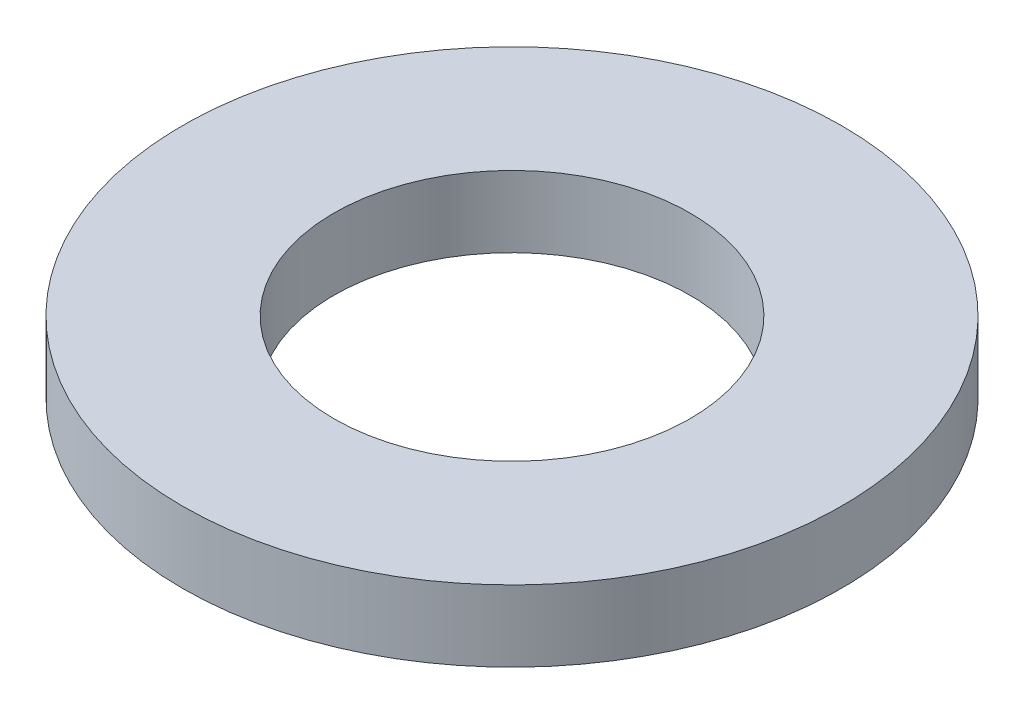
ISO-10303-21;
HEADER;
FILE_DESCRIPTION(('STEP AP214'),'2;1');
FILE_NAME('part.step','',(''),(''),'','','');
FILE_SCHEMA(('AUTOMOTIVE_DESIGN { 1 0 10303 214 1 1 1 1 }'));
ENDSEC;
DATA;
#1=APPLICATION_CONTEXT('core data for automotive mechanical design processes');
#2=APPLICATION_PROTOCOL_DEFINITION('international standard','automotive_design',2000,#1);
#3=PRODUCT_CONTEXT('',#1,'mechanical');
#4=PRODUCT('Part','Part','',(#3));
#5=PRODUCT_RELATED_PRODUCT_CATEGORY('part','',(#4));
#6=PRODUCT_DEFINITION_FORMATION('','',#4);
#7=PRODUCT_DEFINITION_CONTEXT('part definition',#1,'design');
#8=PRODUCT_DEFINITION('design','',#6,#7);
#9=PRODUCT_DEFINITION_SHAPE('','',#8);
#10=(LENGTH_UNIT() NAMED_UNIT(*) SI_UNIT(.MILLI.,.METRE.));
#11=(NAMED_UNIT(*) PLANE_ANGLE_UNIT() SI_UNIT($,.RADIAN.));
#12=(NAMED_UNIT(*) SI_UNIT($,.STERADIAN.) SOLID_ANGLE_UNIT());
#13=UNCERTAINTY_MEASURE_WITH_UNIT(LENGTH_MEASURE(1.E-05),#10,'distance_accuracy_value','');
#14=(GEOMETRIC_REPRESENTATION_CONTEXT(3) GLOBAL_UNCERTAINTY_ASSIGNED_CONTEXT((#13)) GLOBAL_UNIT_ASSIGNED_CONTEXT((#10,
#11,#12)) REPRESENTATION_CONTEXT('',''));
#15=CARTESIAN_POINT('',(0.,0.,0.));
#16=DIRECTION('',(0.,0.,1.));
#17=DIRECTION('',(1.,0.,0.));
#18=AXIS2_PLACEMENT_3D('',#15,#16,#17);
#19=CARTESIAN_POINT('',(0.,20.,0.));
#20=DIRECTION('',(0.,-1.,0.));
#21=DIRECTION('',(0.,0.,-1.));
#22=AXIS2_PLACEMENT_3D('',#19,#20,#21);
#23=CYLINDRICAL_SURFACE('',#22,92.5);
#24=CARTESIAN_POINT('',(0.,20.,0.));
#25=DIRECTION('',(0.,1.,0.));
#26=DIRECTION('',(0.,0.,1.));
#27=AXIS2_PLACEMENT_3D('',#24,#25,#26);
#28=CIRCLE('',#27,92.5);
#29=CARTESIAN_POINT('',(0.,20.,92.5));
#30=VERTEX_POINT('',#29);
#31=EDGE_CURVE('E10',#30,#30,#28,.T.);
#32=ORIENTED_EDGE('',*,*,#31,.F.);
#33=EDGE_LOOP('',(#32));
#34=FACE_BOUND('',#33,.T.);
#35=CARTESIAN_POINT('',(0.,0.,0.));
#36=DIRECTION('',(0.,1.,0.));
#37=DIRECTION('',(0.,0.,1.));
#38=AXIS2_PLACEMENT_3D('',#35,#36,#37);
#39=CIRCLE('',#38,92.5);
#40=CARTESIAN_POINT('',(0.,0.,92.5));
#41=VERTEX_POINT('',#40);
#42=EDGE_CURVE('E37',#41,#41,#39,.T.);
#43=ORIENTED_EDGE('',*,*,#42,.T.);
#44=EDGE_LOOP('',(#43));
#45=FACE_BOUND('',#44,.T.);
#46=ADVANCED_FACE('F40',(#34,#45),#23,.T.);
#47=CARTESIAN_POINT('',(0.,20.,0.));
#48=DIRECTION('',(0.,1.,0.));
#49=DIRECTION('',(0.,0.,1.));
#50=AXIS2_PLACEMENT_3D('',#47,#48,#49);
#51=PLANE('',#50);
#52=CARTESIAN_POINT('',(0.,20.,0.));
#53=DIRECTION('',(0.,1.,0.));
#54=DIRECTION('',(0.,0.,1.));
#55=AXIS2_PLACEMENT_3D('',#52,#53,#54);
#56=CIRCLE('',#55,50.);
#57=CARTESIAN_POINT('',(0.,20.,50.));
#58=VERTEX_POINT('',#57);
#59=EDGE_CURVE('E50',#58,#58,#56,.T.);
#60=ORIENTED_EDGE('',*,*,#59,.F.);
#61=EDGE_LOOP('',(#60));
#62=FACE_BOUND('',#61,.T.);
#63=ORIENTED_EDGE('',*,*,#31,.T.);
#64=EDGE_LOOP('',(#63));
#65=FACE_BOUND('',#64,.T.);
#66=ADVANCED_FACE('F59',(#62,#65),#51,.T.);
#67=CARTESIAN_POINT('',(0.,0.,0.));
#68=DIRECTION('',(0.,1.,0.));
#69=DIRECTION('',(0.,0.,1.));
#70=AXIS2_PLACEMENT_3D('',#67,#68,#69);
#71=PLANE('',#70);
#72=CARTESIAN_POINT('',(0.,0.,0.));
#73=DIRECTION('',(0.,1.,0.));
#74=DIRECTION('',(0.,0.,1.));
#75=AXIS2_PLACEMENT_3D('',#72,#73,#74);
#76=CIRCLE('',#75,50.);
#77=CARTESIAN_POINT('',(0.,0.,50.));
#78=VERTEX_POINT('',#77);
#79=EDGE_CURVE('E47',#78,#78,#76,.T.);
#80=ORIENTED_EDGE('',*,*,#79,.T.);
#81=EDGE_LOOP('',(#80));
#82=FACE_BOUND('',#81,.T.);
#83=ORIENTED_EDGE('',*,*,#42,.F.);
#84=EDGE_LOOP('',(#83));
#85=FACE_BOUND('',#84,.T.);
#86=ADVANCED_FACE('F58',(#82,#85),#71,.F.);
#87=CARTESIAN_POINT('',(0.,20.,0.));
#88=DIRECTION('',(0.,-1.,0.));
#89=DIRECTION('',(0.,0.,-1.));
#90=AXIS2_PLACEMENT_3D('',#87,#88,#89);
#91=CYLINDRICAL_SURFACE('',#90,50.);
#92=ORIENTED_EDGE('',*,*,#59,.T.);
#93=EDGE_LOOP('',(#92));
#94=FACE_BOUND('',#93,.T.);
#95=ORIENTED_EDGE('',*,*,#79,.F.);
#96=EDGE_LOOP('',(#95));
#97=FACE_BOUND('',#96,.T.);
#98=ADVANCED_FACE('F54',(#94,#97),#91,.F.);
#99=CLOSED_SHELL('',(#46,#66,#86,#98));
#100=MANIFOLD_SOLID_BREP('B2',#99);
#101=ADVANCED_BREP_SHAPE_REPRESENTATION('',(#18,#100),#14);
#102=SHAPE_DEFINITION_REPRESENTATION(#9,#101);
ENDSEC;
END-ISO-10303-21;
